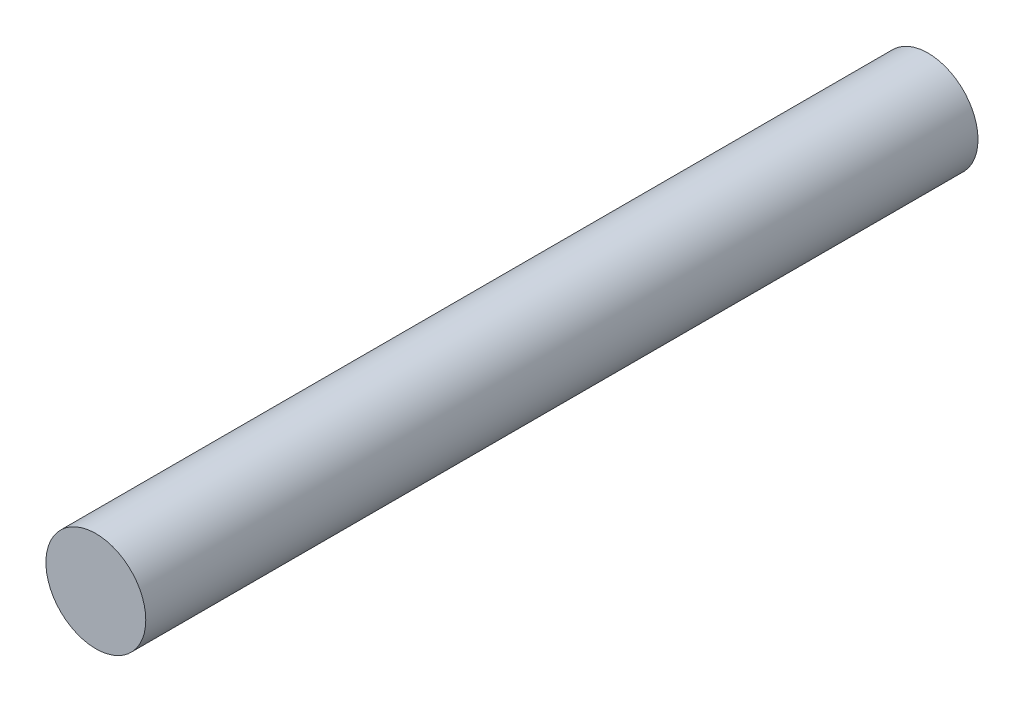
ISO-10303-21;
HEADER;
FILE_DESCRIPTION(('STEP AP214'),'2;1');
FILE_NAME('part.step','',(''),(''),'','','');
FILE_SCHEMA(('AUTOMOTIVE_DESIGN { 1 0 10303 214 1 1 1 1 }'));
ENDSEC;
DATA;
#1=APPLICATION_CONTEXT('core data for automotive mechanical design processes');
#2=APPLICATION_PROTOCOL_DEFINITION('international standard','automotive_design',2000,#1);
#3=PRODUCT_CONTEXT('',#1,'mechanical');
#4=PRODUCT('Part','Part','',(#3));
#5=PRODUCT_RELATED_PRODUCT_CATEGORY('part','',(#4));
#6=PRODUCT_DEFINITION_FORMATION('','',#4);
#7=PRODUCT_DEFINITION_CONTEXT('part definition',#1,'design');
#8=PRODUCT_DEFINITION('design','',#6,#7);
#9=PRODUCT_DEFINITION_SHAPE('','',#8);
#10=(LENGTH_UNIT() NAMED_UNIT(*) SI_UNIT(.MILLI.,.METRE.));
#11=(NAMED_UNIT(*) PLANE_ANGLE_UNIT() SI_UNIT($,.RADIAN.));
#12=(NAMED_UNIT(*) SI_UNIT($,.STERADIAN.) SOLID_ANGLE_UNIT());
#13=UNCERTAINTY_MEASURE_WITH_UNIT(LENGTH_MEASURE(1.E-05),#10,'distance_accuracy_value','');
#14=(GEOMETRIC_REPRESENTATION_CONTEXT(3) GLOBAL_UNCERTAINTY_ASSIGNED_CONTEXT((#13)) GLOBAL_UNIT_ASSIGNED_CONTEXT((#10,
#11,#12)) REPRESENTATION_CONTEXT('',''));
#15=CARTESIAN_POINT('',(0.,0.,0.));
#16=DIRECTION('',(0.,0.,1.));
#17=DIRECTION('',(1.,0.,0.));
#18=AXIS2_PLACEMENT_3D('',#15,#16,#17);
#19=CARTESIAN_POINT('',(0.,0.,50.));
#20=DIRECTION('',(0.,0.,-1.));
#21=DIRECTION('',(-1.,0.,0.));
#22=AXIS2_PLACEMENT_3D('',#19,#20,#21);
#23=CYLINDRICAL_SURFACE('',#22,3.);
#24=CARTESIAN_POINT('',(0.,0.,50.));
#25=DIRECTION('',(0.,0.,1.));
#26=DIRECTION('',(1.,0.,0.));
#27=AXIS2_PLACEMENT_3D('',#24,#25,#26);
#28=CIRCLE('',#27,3.);
#29=CARTESIAN_POINT('',(3.,0.,50.));
#30=VERTEX_POINT('',#29);
#31=EDGE_CURVE('E10',#30,#30,#28,.T.);
#32=ORIENTED_EDGE('',*,*,#31,.F.);
#33=EDGE_LOOP('',(#32));
#34=FACE_BOUND('',#33,.T.);
#35=CARTESIAN_POINT('',(0.,0.,0.));
#36=DIRECTION('',(0.,0.,1.));
#37=DIRECTION('',(1.,0.,0.));
#38=AXIS2_PLACEMENT_3D('',#35,#36,#37);
#39=CIRCLE('',#38,3.);
#40=CARTESIAN_POINT('',(3.,0.,0.));
#41=VERTEX_POINT('',#40);
#42=EDGE_CURVE('E44',#41,#41,#39,.T.);
#43=ORIENTED_EDGE('',*,*,#42,.T.);
#44=EDGE_LOOP('',(#43));
#45=FACE_BOUND('',#44,.T.);
#46=ADVANCED_FACE('F41',(#34,#45),#23,.T.);
#47=CARTESIAN_POINT('',(0.,0.,50.));
#48=DIRECTION('',(0.,0.,1.));
#49=DIRECTION('',(1.,0.,0.));
#50=AXIS2_PLACEMENT_3D('',#47,#48,#49);
#51=PLANE('',#50);
#52=ORIENTED_EDGE('',*,*,#31,.T.);
#53=EDGE_LOOP('',(#52));
#54=FACE_BOUND('',#53,.T.);
#55=ADVANCED_FACE('F58',(#54),#51,.T.);
#56=CARTESIAN_POINT('',(0.,0.,0.));
#57=DIRECTION('',(0.,0.,1.));
#58=DIRECTION('',(1.,0.,0.));
#59=AXIS2_PLACEMENT_3D('',#56,#57,#58);
#60=PLANE('',#59);
#61=ORIENTED_EDGE('',*,*,#42,.F.);
#62=EDGE_LOOP('',(#61));
#63=FACE_BOUND('',#62,.T.);
#64=ADVANCED_FACE('F56',(#63),#60,.F.);
#65=CLOSED_SHELL('',(#46,#55,#64));
#66=MANIFOLD_SOLID_BREP('B2',#65);
#67=ADVANCED_BREP_SHAPE_REPRESENTATION('',(#18,#66),#14);
#68=SHAPE_DEFINITION_REPRESENTATION(#9,#67);
ENDSEC;
END-ISO-10303-21;
